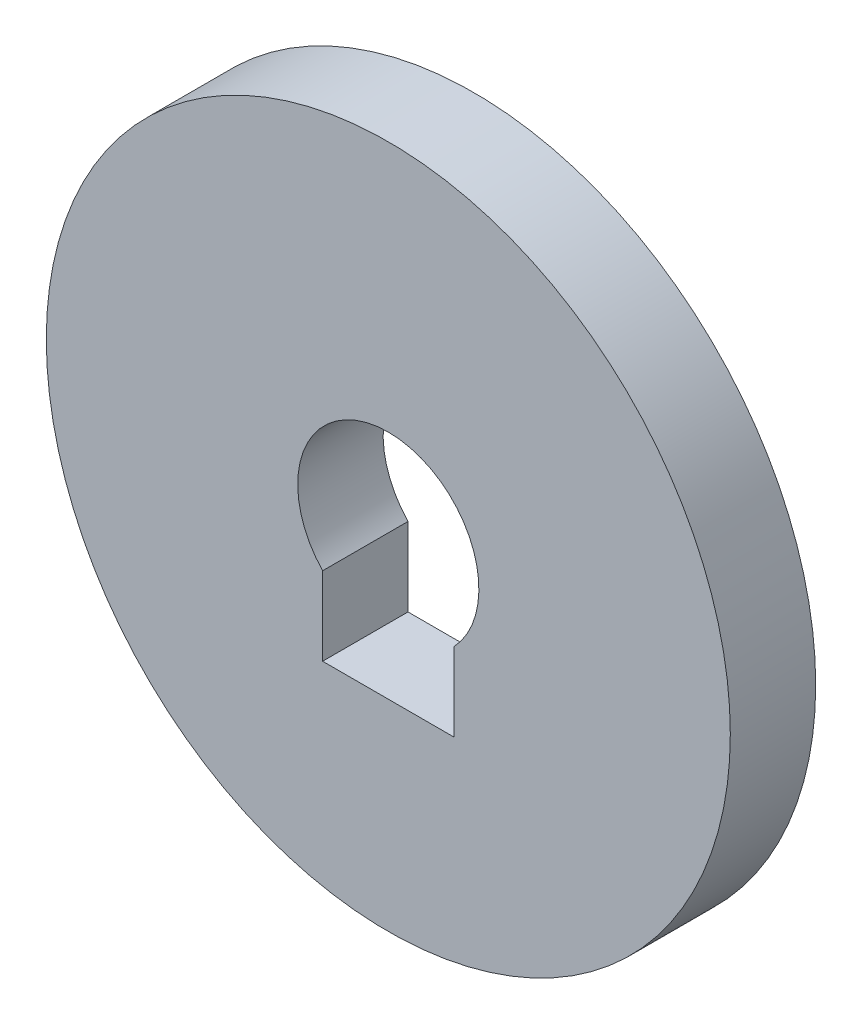
ISO-10303-21;
HEADER;
FILE_DESCRIPTION(('STEP AP214'),'2;1');
FILE_NAME('part.step','',(''),(''),'','','');
FILE_SCHEMA(('AUTOMOTIVE_DESIGN { 1 0 10303 214 1 1 1 1 }'));
ENDSEC;
DATA;
#1=APPLICATION_CONTEXT('core data for automotive mechanical design processes');
#2=APPLICATION_PROTOCOL_DEFINITION('international standard','automotive_design',2000,#1);
#3=PRODUCT_CONTEXT('',#1,'mechanical');
#4=PRODUCT('Part','Part','',(#3));
#5=PRODUCT_RELATED_PRODUCT_CATEGORY('part','',(#4));
#6=PRODUCT_DEFINITION_FORMATION('','',#4);
#7=PRODUCT_DEFINITION_CONTEXT('part definition',#1,'design');
#8=PRODUCT_DEFINITION('design','',#6,#7);
#9=PRODUCT_DEFINITION_SHAPE('','',#8);
#10=(LENGTH_UNIT() NAMED_UNIT(*) SI_UNIT(.MILLI.,.METRE.));
#11=(NAMED_UNIT(*) PLANE_ANGLE_UNIT() SI_UNIT($,.RADIAN.));
#12=(NAMED_UNIT(*) SI_UNIT($,.STERADIAN.) SOLID_ANGLE_UNIT());
#13=UNCERTAINTY_MEASURE_WITH_UNIT(LENGTH_MEASURE(1.E-05),#10,'distance_accuracy_value','');
#14=(GEOMETRIC_REPRESENTATION_CONTEXT(3) GLOBAL_UNCERTAINTY_ASSIGNED_CONTEXT((#13)) GLOBAL_UNIT_ASSIGNED_CONTEXT((#10,
#11,#12)) REPRESENTATION_CONTEXT('',''));
#15=CARTESIAN_POINT('',(0.,0.,0.));
#16=DIRECTION('',(0.,0.,1.));
#17=DIRECTION('',(1.,0.,0.));
#18=AXIS2_PLACEMENT_3D('',#15,#16,#17);
#19=CARTESIAN_POINT('',(0.,-150.,91.));
#20=DIRECTION('',(0.,-1.,0.));
#21=DIRECTION('',(0.,0.,-1.));
#22=AXIS2_PLACEMENT_3D('',#19,#20,#21);
#23=PLANE('',#22);
#24=DIRECTION('',(-1.,0.,0.));
#25=VECTOR('',#24,1.);
#26=CARTESIAN_POINT('',(0.,-150.,0.));
#27=LINE('',#26,#25);
#28=CARTESIAN_POINT('',(70.,-150.,0.));
#29=VERTEX_POINT('',#28);
#30=CARTESIAN_POINT('',(-70.,-150.,0.));
#31=VERTEX_POINT('',#30);
#32=EDGE_CURVE('E107',#29,#31,#27,.T.);
#33=ORIENTED_EDGE('',*,*,#32,.T.);
#34=DIRECTION('',(0.,0.,-1.));
#35=VECTOR('',#34,1.);
#36=CARTESIAN_POINT('',(-70.,-150.,91.));
#37=LINE('',#36,#35);
#38=CARTESIAN_POINT('',(-70.,-150.,91.));
#39=VERTEX_POINT('',#38);
#40=EDGE_CURVE('E11',#39,#31,#37,.T.);
#41=ORIENTED_EDGE('',*,*,#40,.F.);
#42=DIRECTION('',(-1.,0.,0.));
#43=VECTOR('',#42,1.);
#44=CARTESIAN_POINT('',(0.,-150.,91.));
#45=LINE('',#44,#43);
#46=CARTESIAN_POINT('',(70.,-150.,91.));
#47=VERTEX_POINT('',#46);
#48=EDGE_CURVE('E80',#47,#39,#45,.T.);
#49=ORIENTED_EDGE('',*,*,#48,.F.);
#50=DIRECTION('',(0.,0.,-1.));
#51=VECTOR('',#50,1.);
#52=CARTESIAN_POINT('',(70.,-150.,91.));
#53=LINE('',#52,#51);
#54=EDGE_CURVE('E106',#47,#29,#53,.T.);
#55=ORIENTED_EDGE('',*,*,#54,.T.);
#56=EDGE_LOOP('',(#33,#41,#49,#55));
#57=FACE_BOUND('',#56,.T.);
#58=ADVANCED_FACE('F41',(#57),#23,.F.);
#59=CARTESIAN_POINT('',(-70.,0.,91.));
#60=DIRECTION('',(1.,0.,0.));
#61=DIRECTION('',(0.,0.,-1.));
#62=AXIS2_PLACEMENT_3D('',#59,#60,#61);
#63=PLANE('',#62);
#64=DIRECTION('',(0.,-1.,0.));
#65=VECTOR('',#64,1.);
#66=CARTESIAN_POINT('',(-70.,0.,0.));
#67=LINE('',#66,#65);
#68=CARTESIAN_POINT('',(-70.,-66.4671063121313,0.));
#69=VERTEX_POINT('',#68);
#70=EDGE_CURVE('E89',#69,#31,#67,.T.);
#71=ORIENTED_EDGE('',*,*,#70,.F.);
#72=DIRECTION('',(0.,0.,-1.));
#73=VECTOR('',#72,1.);
#74=CARTESIAN_POINT('',(-70.,-66.4671063121313,91.));
#75=LINE('',#74,#73);
#76=CARTESIAN_POINT('',(-70.,-66.4671063121313,91.));
#77=VERTEX_POINT('',#76);
#78=EDGE_CURVE('E49',#77,#69,#75,.T.);
#79=ORIENTED_EDGE('',*,*,#78,.F.);
#80=DIRECTION('',(0.,-1.,0.));
#81=VECTOR('',#80,1.);
#82=CARTESIAN_POINT('',(-70.,0.,91.));
#83=LINE('',#82,#81);
#84=EDGE_CURVE('E87',#77,#39,#83,.T.);
#85=ORIENTED_EDGE('',*,*,#84,.T.);
#86=ORIENTED_EDGE('',*,*,#40,.T.);
#87=EDGE_LOOP('',(#71,#79,#85,#86));
#88=FACE_BOUND('',#87,.T.);
#89=ADVANCED_FACE('F86',(#88),#63,.T.);
#90=CARTESIAN_POINT('',(0.,0.,91.));
#91=DIRECTION('',(0.,0.,-1.));
#92=DIRECTION('',(-1.,0.,0.));
#93=AXIS2_PLACEMENT_3D('',#90,#91,#92);
#94=CYLINDRICAL_SURFACE('',#93,96.5291470049755);
#95=CARTESIAN_POINT('',(0.,0.,0.));
#96=DIRECTION('',(0.,0.,1.));
#97=DIRECTION('',(1.,0.,0.));
#98=AXIS2_PLACEMENT_3D('',#95,#96,#97);
#99=CIRCLE('',#98,96.5291470049755);
#100=CARTESIAN_POINT('',(70.,-66.4671063121313,0.));
#101=VERTEX_POINT('',#100);
#102=EDGE_CURVE('E111',#101,#69,#99,.T.);
#103=ORIENTED_EDGE('',*,*,#102,.F.);
#104=DIRECTION('',(0.,0.,-1.));
#105=VECTOR('',#104,1.);
#106=CARTESIAN_POINT('',(70.,-66.4671063121313,91.));
#107=LINE('',#106,#105);
#108=CARTESIAN_POINT('',(70.,-66.4671063121313,91.));
#109=VERTEX_POINT('',#108);
#110=EDGE_CURVE('E72',#109,#101,#107,.T.);
#111=ORIENTED_EDGE('',*,*,#110,.F.);
#112=CARTESIAN_POINT('',(0.,0.,91.));
#113=DIRECTION('',(0.,0.,1.));
#114=DIRECTION('',(1.,0.,0.));
#115=AXIS2_PLACEMENT_3D('',#112,#113,#114);
#116=CIRCLE('',#115,96.5291470049755);
#117=EDGE_CURVE('E96',#109,#77,#116,.T.);
#118=ORIENTED_EDGE('',*,*,#117,.T.);
#119=ORIENTED_EDGE('',*,*,#78,.T.);
#120=EDGE_LOOP('',(#103,#111,#118,#119));
#121=FACE_BOUND('',#120,.T.);
#122=ADVANCED_FACE('F98',(#121),#94,.F.);
#123=CARTESIAN_POINT('',(70.,0.,91.));
#124=DIRECTION('',(1.,0.,0.));
#125=DIRECTION('',(0.,0.,-1.));
#126=AXIS2_PLACEMENT_3D('',#123,#124,#125);
#127=PLANE('',#126);
#128=DIRECTION('',(0.,-1.,0.));
#129=VECTOR('',#128,1.);
#130=CARTESIAN_POINT('',(70.,0.,0.));
#131=LINE('',#130,#129);
#132=EDGE_CURVE('E75',#101,#29,#131,.T.);
#133=ORIENTED_EDGE('',*,*,#132,.T.);
#134=ORIENTED_EDGE('',*,*,#54,.F.);
#135=DIRECTION('',(0.,-1.,0.));
#136=VECTOR('',#135,1.);
#137=CARTESIAN_POINT('',(70.,0.,91.));
#138=LINE('',#137,#136);
#139=EDGE_CURVE('E57',#109,#47,#138,.T.);
#140=ORIENTED_EDGE('',*,*,#139,.F.);
#141=ORIENTED_EDGE('',*,*,#110,.T.);
#142=EDGE_LOOP('',(#133,#134,#140,#141));
#143=FACE_BOUND('',#142,.T.);
#144=ADVANCED_FACE('F129',(#143),#127,.F.);
#145=CARTESIAN_POINT('',(0.,0.,91.));
#146=DIRECTION('',(0.,0.,-1.));
#147=DIRECTION('',(-1.,0.,0.));
#148=AXIS2_PLACEMENT_3D('',#145,#146,#147);
#149=CYLINDRICAL_SURFACE('',#148,364.5);
#150=CARTESIAN_POINT('',(0.,0.,91.));
#151=DIRECTION('',(0.,0.,1.));
#152=DIRECTION('',(1.,0.,0.));
#153=AXIS2_PLACEMENT_3D('',#150,#151,#152);
#154=CIRCLE('',#153,364.5);
#155=CARTESIAN_POINT('',(364.5,0.,91.));
#156=VERTEX_POINT('',#155);
#157=EDGE_CURVE('E100',#156,#156,#154,.T.);
#158=ORIENTED_EDGE('',*,*,#157,.F.);
#159=EDGE_LOOP('',(#158));
#160=FACE_BOUND('',#159,.T.);
#161=CARTESIAN_POINT('',(0.,0.,0.));
#162=DIRECTION('',(0.,0.,1.));
#163=DIRECTION('',(1.,0.,0.));
#164=AXIS2_PLACEMENT_3D('',#161,#162,#163);
#165=CIRCLE('',#164,364.5);
#166=CARTESIAN_POINT('',(364.5,0.,0.));
#167=VERTEX_POINT('',#166);
#168=EDGE_CURVE('E114',#167,#167,#165,.T.);
#169=ORIENTED_EDGE('',*,*,#168,.T.);
#170=EDGE_LOOP('',(#169));
#171=FACE_BOUND('',#170,.T.);
#172=ADVANCED_FACE('F127',(#160,#171),#149,.T.);
#173=CARTESIAN_POINT('',(0.,0.,91.));
#174=DIRECTION('',(0.,0.,1.));
#175=DIRECTION('',(1.,0.,0.));
#176=AXIS2_PLACEMENT_3D('',#173,#174,#175);
#177=PLANE('',#176);
#178=ORIENTED_EDGE('',*,*,#48,.T.);
#179=ORIENTED_EDGE('',*,*,#84,.F.);
#180=ORIENTED_EDGE('',*,*,#117,.F.);
#181=ORIENTED_EDGE('',*,*,#139,.T.);
#182=EDGE_LOOP('',(#178,#179,#180,#181));
#183=FACE_BOUND('',#182,.T.);
#184=ORIENTED_EDGE('',*,*,#157,.T.);
#185=EDGE_LOOP('',(#184));
#186=FACE_BOUND('',#185,.T.);
#187=ADVANCED_FACE('F94',(#183,#186),#177,.T.);
#188=CARTESIAN_POINT('',(0.,0.,0.));
#189=DIRECTION('',(0.,0.,1.));
#190=DIRECTION('',(1.,0.,0.));
#191=AXIS2_PLACEMENT_3D('',#188,#189,#190);
#192=PLANE('',#191);
#193=ORIENTED_EDGE('',*,*,#32,.F.);
#194=ORIENTED_EDGE('',*,*,#132,.F.);
#195=ORIENTED_EDGE('',*,*,#102,.T.);
#196=ORIENTED_EDGE('',*,*,#70,.T.);
#197=EDGE_LOOP('',(#193,#194,#195,#196));
#198=FACE_BOUND('',#197,.T.);
#199=ORIENTED_EDGE('',*,*,#168,.F.);
#200=EDGE_LOOP('',(#199));
#201=FACE_BOUND('',#200,.T.);
#202=ADVANCED_FACE('F121',(#198,#201),#192,.F.);
#203=CLOSED_SHELL('',(#58,#89,#122,#144,#172,#187,#202));
#204=MANIFOLD_SOLID_BREP('B2',#203);
#205=ADVANCED_BREP_SHAPE_REPRESENTATION('',(#18,#204),#14);
#206=SHAPE_DEFINITION_REPRESENTATION(#9,#205);
ENDSEC;
END-ISO-10303-21;
